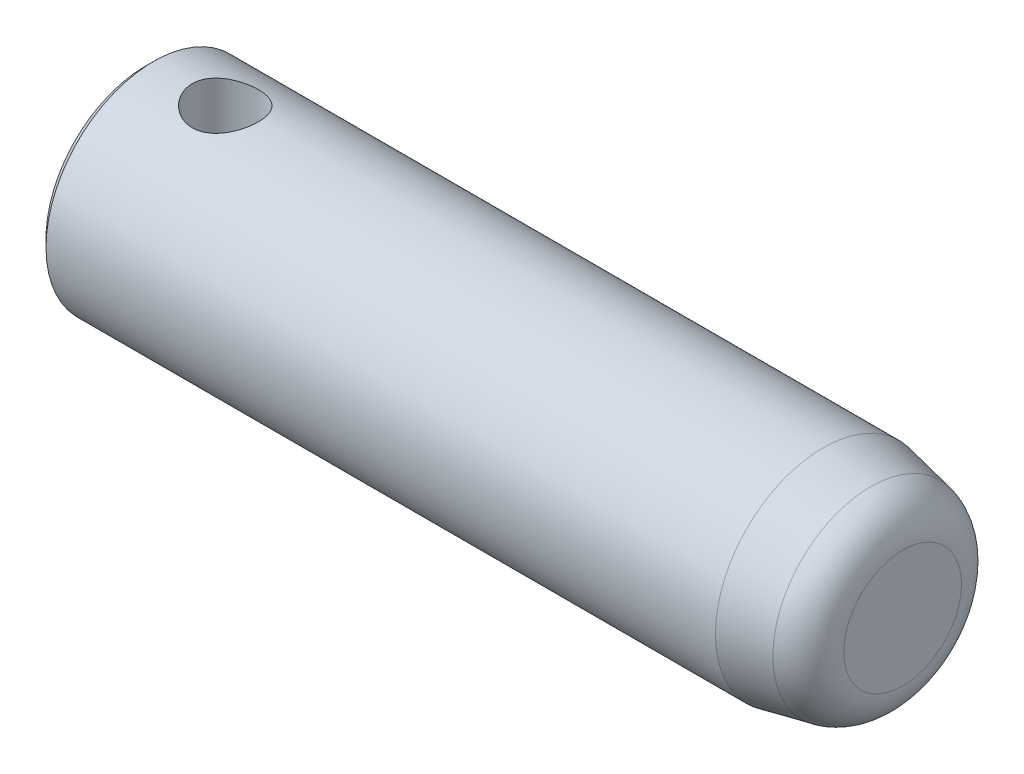
ISO-10303-21;
HEADER;
FILE_DESCRIPTION(('STEP AP214'),'2;1');
FILE_NAME('part.step','',(''),(''),'','','');
FILE_SCHEMA(('AUTOMOTIVE_DESIGN { 1 0 10303 214 1 1 1 1 }'));
ENDSEC;
DATA;
#1=APPLICATION_CONTEXT('core data for automotive mechanical design processes');
#2=APPLICATION_PROTOCOL_DEFINITION('international standard','automotive_design',2000,#1);
#3=PRODUCT_CONTEXT('',#1,'mechanical');
#4=PRODUCT('Part','Part','',(#3));
#5=PRODUCT_RELATED_PRODUCT_CATEGORY('part','',(#4));
#6=PRODUCT_DEFINITION_FORMATION('','',#4);
#7=PRODUCT_DEFINITION_CONTEXT('part definition',#1,'design');
#8=PRODUCT_DEFINITION('design','',#6,#7);
#9=PRODUCT_DEFINITION_SHAPE('','',#8);
#10=(LENGTH_UNIT() NAMED_UNIT(*) SI_UNIT(.MILLI.,.METRE.));
#11=(NAMED_UNIT(*) PLANE_ANGLE_UNIT() SI_UNIT($,.RADIAN.));
#12=(NAMED_UNIT(*) SI_UNIT($,.STERADIAN.) SOLID_ANGLE_UNIT());
#13=UNCERTAINTY_MEASURE_WITH_UNIT(LENGTH_MEASURE(1.E-05),#10,'distance_accuracy_value','');
#14=(GEOMETRIC_REPRESENTATION_CONTEXT(3) GLOBAL_UNCERTAINTY_ASSIGNED_CONTEXT((#13)) GLOBAL_UNIT_ASSIGNED_CONTEXT((#10,
#11,#12)) REPRESENTATION_CONTEXT('',''));
#15=CARTESIAN_POINT('',(0.,0.,0.));
#16=DIRECTION('',(0.,0.,1.));
#17=DIRECTION('',(1.,0.,0.));
#18=AXIS2_PLACEMENT_3D('',#15,#16,#17);
#19=CARTESIAN_POINT('',(95.,0.,0.));
#20=DIRECTION('',(-1.,0.,0.));
#21=DIRECTION('',(0.,0.,1.));
#22=AXIS2_PLACEMENT_3D('',#19,#20,#21);
#23=CYLINDRICAL_SURFACE('',#22,13.5);
#24=CARTESIAN_POINT('',(5.85,-13.5,0.));
#25=CARTESIAN_POINT('',(5.85000202340181,-13.4999985114752,0.227402156007268));
#26=CARTESIAN_POINT('',(5.86875273926511,-13.4941997302581,0.454824968339302));
#27=CARTESIAN_POINT('',(5.94307125364936,-13.4716346966968,0.903031316792986));
#28=CARTESIAN_POINT('',(5.99864847090315,-13.4548656386125,1.12381313931206));
#29=CARTESIAN_POINT('',(6.14457699874578,-13.4121942288627,1.55220891966356));
#30=CARTESIAN_POINT('',(6.23487551705309,-13.3863057478862,1.75984231361689));
#31=CARTESIAN_POINT('',(6.44746213115252,-13.3280758153734,2.1570209355603));
#32=CARTESIAN_POINT('',(6.56975494935885,-13.2957334113942,2.34656348766923));
#33=CARTESIAN_POINT('',(6.84672125546269,-13.2269507421959,2.70786538277092));
#34=CARTESIAN_POINT('',(7.00218042183089,-13.1904233620054,2.87900580260451));
#35=CARTESIAN_POINT('',(7.33939296074517,-13.1178983594875,3.19324322225718));
#36=CARTESIAN_POINT('',(7.52115102099837,-13.0819008328682,3.33633521178909));
#37=CARTESIAN_POINT('',(7.91111002046801,-13.0135819629174,3.59372900090108));
#38=CARTESIAN_POINT('',(8.11983715068285,-12.9813684442808,3.70726493005124));
#39=CARTESIAN_POINT('',(8.55457239406956,-12.9255717824294,3.89736840380634));
#40=CARTESIAN_POINT('',(8.78057610485526,-12.9019864494003,3.97394533010134));
#41=CARTESIAN_POINT('',(9.23647883648235,-12.867026401145,4.08570588385706));
#42=CARTESIAN_POINT('',(9.46607056790325,-12.8553147095788,4.12203473020294));
#43=CARTESIAN_POINT('',(9.92836599565647,-12.8444266713359,4.15584500674148));
#44=CARTESIAN_POINT('',(10.1610688799085,-12.8452471149403,4.15333638394895));
#45=CARTESIAN_POINT('',(10.6135742797313,-12.8590327013092,4.11044021260337));
#46=CARTESIAN_POINT('',(10.8335304736431,-12.8715338595716,4.07149974371518));
#47=CARTESIAN_POINT('',(11.263623003534,-12.9065198430853,3.95918810327311));
#48=CARTESIAN_POINT('',(11.4737583241693,-12.9290056981048,3.88581338030964));
#49=CARTESIAN_POINT('',(11.8817293241424,-12.9817891067039,3.70567612723075));
#50=CARTESIAN_POINT('',(12.0793472718526,-13.0121933290453,3.5984530779988));
#51=CARTESIAN_POINT('',(12.4542645180682,-13.0773378249785,3.35398276504338));
#52=CARTESIAN_POINT('',(12.6315586656091,-13.1120791931579,3.21672791543712));
#53=CARTESIAN_POINT('',(12.968987565674,-13.1838532734004,2.90895386576822));
#54=CARTESIAN_POINT('',(13.1280251328282,-13.2209195702755,2.73723745155003));
#55=CARTESIAN_POINT('',(13.4153084348377,-13.2918172589167,2.36911014946947));
#56=CARTESIAN_POINT('',(13.5435520334012,-13.3256484261519,2.17269754978058));
#57=CARTESIAN_POINT('',(13.7663184515394,-13.3865998005739,1.75868848152416));
#58=CARTESIAN_POINT('',(13.8605871185585,-13.4136689807238,1.54094724254517));
#59=CARTESIAN_POINT('',(14.0108363972219,-13.457678365562,1.09167347800342));
#60=CARTESIAN_POINT('',(14.066828243966,-13.4746215422742,0.860145021006421));
#61=CARTESIAN_POINT('',(14.1370829400978,-13.4959950029713,0.399188106412072));
#62=CARTESIAN_POINT('',(14.1528317975624,-13.5008706668949,0.170006448803975));
#63=CARTESIAN_POINT('',(14.1463330724631,-13.498872619694,-0.287745416691621));
#64=CARTESIAN_POINT('',(14.1240908422031,-13.4920005636251,-0.516315706166913));
#65=CARTESIAN_POINT('',(14.043437895994,-13.4675714515657,-0.960675494497211));
#66=CARTESIAN_POINT('',(13.9859048486332,-13.4502738512498,-1.17663991931202));
#67=CARTESIAN_POINT('',(13.8373681819906,-13.4070082324494,-1.59579566926548));
#68=CARTESIAN_POINT('',(13.7463604713559,-13.381039154152,-1.79898542949823));
#69=CARTESIAN_POINT('',(13.5310238449964,-13.3223373717104,-2.19221812267538));
#70=CARTESIAN_POINT('',(13.4059511280695,-13.2894579633788,-2.38183124869987));
#71=CARTESIAN_POINT('',(13.1269318949357,-13.220701610105,-2.73787962413219));
#72=CARTESIAN_POINT('',(12.9729777899448,-13.1848238787098,-2.90430876171323));
#73=CARTESIAN_POINT('',(12.6335792260664,-13.1123897918169,-3.21587033057997));
#74=CARTESIAN_POINT('',(12.4471553110202,-13.075859990711,-3.35994433065731));
#75=CARTESIAN_POINT('',(12.0519825161036,-13.0077026722783,-3.61485020488153));
#76=CARTESIAN_POINT('',(11.8432340927135,-12.9760750547466,-3.7256827585564));
#77=CARTESIAN_POINT('',(11.4098705696321,-12.9216601439022,-3.91023966396336));
#78=CARTESIAN_POINT('',(11.1853270931831,-12.8988356468056,-3.98412058305053));
#79=CARTESIAN_POINT('',(10.7261463855507,-12.8647768867868,-4.09277666601773));
#80=CARTESIAN_POINT('',(10.4915128685211,-12.853538396449,-4.12756609372601));
#81=CARTESIAN_POINT('',(10.0298484534816,-12.8443547896536,-4.15604952644762));
#82=CARTESIAN_POINT('',(9.80293419356281,-12.8458494569784,-4.15147530687562));
#83=CARTESIAN_POINT('',(9.35327329552538,-12.8606085993591,-4.10552258575548));
#84=CARTESIAN_POINT('',(9.13052647502666,-12.8738725581183,-4.06414569867098));
#85=CARTESIAN_POINT('',(8.69851045070577,-12.9102906828205,-3.94690468087593));
#86=CARTESIAN_POINT('',(8.48909840021822,-12.9333068485791,-3.87152084296221));
#87=CARTESIAN_POINT('',(8.08572717691659,-12.9866047993612,-3.6887820730902));
#88=CARTESIAN_POINT('',(7.89177108265201,-13.0168880270587,-3.58142079187376));
#89=CARTESIAN_POINT('',(7.51683686550757,-13.0827447309675,-3.33299815357153));
#90=CARTESIAN_POINT('',(7.33663257207719,-13.1184755716584,-3.19081067615643));
#91=CARTESIAN_POINT('',(7.00208083647706,-13.1904614239745,-2.87877202274273));
#92=CARTESIAN_POINT('',(6.84774024503557,-13.2267165717234,-2.7089135407234));
#93=CARTESIAN_POINT('',(6.56448108276189,-13.2970238815157,-2.3399697344458));
#94=CARTESIAN_POINT('',(6.43650688508655,-13.3309718952768,-2.14013736722608));
#95=CARTESIAN_POINT('',(6.21614372184271,-13.3915568619035,-1.72075073501905));
#96=CARTESIAN_POINT('',(6.1237396618073,-13.4181969145775,-1.50120488448952));
#97=CARTESIAN_POINT('',(5.9845018162803,-13.4591133603792,-1.0699118830548));
#98=CARTESIAN_POINT('',(5.93420534725839,-13.4743153877928,-0.859366298679375));
#99=CARTESIAN_POINT('',(5.86695659896587,-13.4947584828185,-0.432552652041231));
#100=CARTESIAN_POINT('',(5.84999807551158,-13.5000014157587,-0.216285669086049));
#101=CARTESIAN_POINT('',(5.85,-13.5,0.));
#102=B_SPLINE_CURVE_WITH_KNOTS('',3,(#24,#25,#26,#27,#28,#29,#30,#31,#32,#33,#34,#35,#36,#37,
#38,#39,#40,#41,#42,#43,#44,#45,#46,#47,#48,#49,#50,#51,#52,#53,#54,#55,#56,#57,#58,#59,#60,#61,
#62,#63,#64,#65,#66,#67,#68,#69,#70,#71,#72,#73,#74,#75,#76,#77,#78,#79,#80,#81,#82,#83,#84,#85,
#86,#87,#88,#89,#90,#91,#92,#93,#94,#95,#96,#97,#98,#99,#100,#101),.UNSPECIFIED.,.T.,.F.,(4,2,2,
2,2,2,2,2,2,2,2,2,2,2,2,2,2,2,2,2,2,2,2,2,2,2,2,2,2,2,2,2,2,2,2,2,2,2,4),(0.,0.681411690440881,
1.36299772579499,2.04355151003841,2.72420580193038,3.42325233322634,4.1224236215387,
4.83822754434267,5.55384967146527,6.24854021504379,6.94305283810007,7.61109995028716,
8.27921597729631,8.95684502644676,9.63464543931847,10.3422469398868,11.0498975152189,
11.7627369355173,12.4753670316182,13.1612752230664,13.8470867895824,14.5164975718987,
15.1859901983923,15.871470040127,16.5571302493392,17.2690237307241,17.9809026584545,
18.6897391832454,19.3983169814273,20.0758863108633,20.7534259180761,21.4216822525062,
22.0900713606422,22.7838735745449,23.4778592719708,24.1935164223663,24.9088695423617,
25.5570920478896,26.2051931300331),.UNSPECIFIED.);
#103=CARTESIAN_POINT('',(5.85,-13.5,0.));
#104=VERTEX_POINT('',#103);
#105=EDGE_CURVE('E10',#104,#104,#102,.T.);
#106=ORIENTED_EDGE('',*,*,#105,.T.);
#107=EDGE_LOOP('',(#106));
#108=FACE_BOUND('',#107,.T.);
#109=CARTESIAN_POINT('',(10.,12.8463029701156,4.15));
#110=CARTESIAN_POINT('',(9.77288449885896,12.8463047842096,4.14999791484521));
#111=CARTESIAN_POINT('',(9.54574827118026,12.8523917865702,4.13129275762828));
#112=CARTESIAN_POINT('',(9.09813541595152,12.8759787683418,4.05717160171071));
#113=CARTESIAN_POINT('',(8.87766078166853,12.8934821290287,4.0017447267632));
#114=CARTESIAN_POINT('',(8.4499179024404,12.9377361113224,3.856255299434));
#115=CARTESIAN_POINT('',(8.24262758492175,12.9644707685038,3.76625251191156));
#116=CARTESIAN_POINT('',(7.84603384222285,13.0241530776548,3.55436430480319));
#117=CARTESIAN_POINT('',(7.6567334047186,13.0571017589184,3.43247360199043));
#118=CARTESIAN_POINT('',(7.29520133405408,13.1267278392127,3.1559315543126));
#119=CARTESIAN_POINT('',(7.12365575147214,13.1634876680811,3.00040385949659));
#120=CARTESIAN_POINT('',(6.8086242097277,13.2358916135968,2.66287906943618));
#121=CARTESIAN_POINT('',(6.66514203826471,13.2715355790922,2.48087840692568));
#122=CARTESIAN_POINT('',(6.4073027797623,13.338631872184,2.09066440767528));
#123=CARTESIAN_POINT('',(6.29364932709461,13.3699757983396,1.8819658605435));
#124=CARTESIAN_POINT('',(6.10332112394402,13.4239798326833,1.44728956570271));
#125=CARTESIAN_POINT('',(6.02663797801328,13.446641912159,1.22131575448505));
#126=CARTESIAN_POINT('',(5.91470944339354,13.4801454834137,0.765684369091679));
#127=CARTESIAN_POINT('',(5.87829211538088,13.4913205782832,0.536339665430527));
#128=CARTESIAN_POINT('',(5.84421886853166,13.5017678782203,0.074541337623861));
#129=CARTESIAN_POINT('',(5.84655441473565,13.5010427042114,-0.157911590695686));
#130=CARTESIAN_POINT('',(5.88914320471778,13.4880049130053,-0.611090556462095));
#131=CARTESIAN_POINT('',(5.92812656210611,13.4760803789996,-0.831948873919814));
#132=CARTESIAN_POINT('',(6.04082455358163,13.4424587007822,-1.26382158570544));
#133=CARTESIAN_POINT('',(6.11454142714086,13.4207609264368,-1.47483534433303));
#134=CARTESIAN_POINT('',(6.29544783264006,13.3695033996681,-1.88399546018735));
#135=CARTESIAN_POINT('',(6.40302848427346,13.3398524133939,-2.08195698696888));
#136=CARTESIAN_POINT('',(6.64829668956187,13.2758211993198,-2.45741721809194));
#137=CARTESIAN_POINT('',(6.78599166582034,13.2414398063416,-2.63491086099056));
#138=CARTESIAN_POINT('',(7.09412704323475,13.1699765733594,-2.97197187035371));
#139=CARTESIAN_POINT('',(7.26566539710195,13.1328417504362,-3.13052564885637));
#140=CARTESIAN_POINT('',(7.6332499503723,13.0612618732235,-3.416911664224));
#141=CARTESIAN_POINT('',(7.8292988419596,13.0268171150811,-3.54474052181601));
#142=CARTESIAN_POINT('',(8.24312256386861,12.9642557899595,-3.76717659675817));
#143=CARTESIAN_POINT('',(8.46110408668669,12.9362095404299,-3.86142051742425));
#144=CARTESIAN_POINT('',(8.91091060566633,12.8904492968349,-4.01155180899296));
#145=CARTESIAN_POINT('',(9.14273078784329,12.8727317326059,-4.06745243463537));
#146=CARTESIAN_POINT('',(9.60394948408696,12.8504237182641,-4.13737998578399));
#147=CARTESIAN_POINT('',(9.83309009356361,12.8453484458011,-4.15295436448047));
#148=CARTESIAN_POINT('',(10.2907224776814,12.8475558187241,-4.14612211739931));
#149=CARTESIAN_POINT('',(10.5192143435984,12.8548366295615,-4.12372112995123));
#150=CARTESIAN_POINT('',(10.9624870510525,12.8804582994468,-4.04295502268181));
#151=CARTESIAN_POINT('',(11.1774723593521,12.898487307467,-3.98560297671617));
#152=CARTESIAN_POINT('',(11.5947485986119,12.9432465562406,-3.83774611218052));
#153=CARTESIAN_POINT('',(11.7970374978707,12.9699781853896,-3.74723600336243));
#154=CARTESIAN_POINT('',(12.1894292662159,13.0300580801291,-3.53274483261642));
#155=CARTESIAN_POINT('',(12.3790339859478,13.0635702934754,-3.40789954340683));
#156=CARTESIAN_POINT('',(12.735166708153,13.1330907287301,-3.1292979656566));
#157=CARTESIAN_POINT('',(12.9016888910507,13.1690995766703,-2.9755344091802));
#158=CARTESIAN_POINT('',(13.2137817941,13.2412950293509,-2.63615858155592));
#159=CARTESIAN_POINT('',(13.3582511477337,13.2774313766643,-2.44952016933533));
#160=CARTESIAN_POINT('',(13.6138564567792,13.344369547755,-2.0537803483545));
#161=CARTESIAN_POINT('',(13.7249939977936,13.3751716252554,-1.84468000875659));
#162=CARTESIAN_POINT('',(13.9097104889776,13.4277892680528,-1.41128233901749));
#163=CARTESIAN_POINT('',(13.9835655074833,13.4496706492953,-1.18711107028729));
#164=CARTESIAN_POINT('',(14.0922941645326,13.4822715286278,-0.728741372138431));
#165=CARTESIAN_POINT('',(14.127179568685,13.4929943956016,-0.494545991359257));
#166=CARTESIAN_POINT('',(14.1560479258765,13.5018542990328,-0.0329305123319394));
#167=CARTESIAN_POINT('',(14.1516243064606,13.500481657559,0.194381729843089));
#168=CARTESIAN_POINT('',(14.1058353402755,13.4864714831434,0.644879959588649));
#169=CARTESIAN_POINT('',(14.0644722707646,13.4738346446215,0.86806620065486));
#170=CARTESIAN_POINT('',(13.9469817509808,13.4388648547716,1.30140631905661));
#171=CARTESIAN_POINT('',(13.8712689797515,13.4166477135907,1.51168261907092));
#172=CARTESIAN_POINT('',(13.6876011949254,13.3648107667423,1.91665250020114));
#173=CARTESIAN_POINT('',(13.579640741196,13.335189712184,2.11134344506003));
#174=CARTESIAN_POINT('',(13.3303995360331,13.27042328993,2.48663408704732));
#175=CARTESIAN_POINT('',(13.18813302969,13.2351273660123,2.6665528873539));
#176=CARTESIAN_POINT('',(12.8760717238212,13.1634441732756,3.00049402614425));
#177=CARTESIAN_POINT('',(12.7062688156049,13.1270565855729,3.15450870930119));
#178=CARTESIAN_POINT('',(12.3374894263298,13.0559430285234,3.43719476764095));
#179=CARTESIAN_POINT('',(12.1377578603029,13.0213064956527,3.5649062440569));
#180=CARTESIAN_POINT('',(11.7186376074969,12.9591050848439,3.78480218816787));
#181=CARTESIAN_POINT('',(11.4992575478503,12.9315371236233,3.87700215468403));
#182=CARTESIAN_POINT('',(11.068426540922,12.8890467191889,4.01587437323286));
#183=CARTESIAN_POINT('',(10.8581877305809,12.8731749494369,4.06602756781778));
#184=CARTESIAN_POINT('',(10.4319713212141,12.8518033874259,4.13308760585193));
#185=CARTESIAN_POINT('',(10.2159950338688,12.8463012448467,4.15000198305742));
#186=CARTESIAN_POINT('',(10.,12.8463029701156,4.15));
#187=B_SPLINE_CURVE_WITH_KNOTS('',3,(#109,#110,#111,#112,#113,#114,#115,#116,#117,#118,#119,
#120,#121,#122,#123,#124,#125,#126,#127,#128,#129,#130,#131,#132,#133,#134,#135,#136,#137,#138,
#139,#140,#141,#142,#143,#144,#145,#146,#147,#148,#149,#150,#151,#152,#153,#154,#155,#156,#157,
#158,#159,#160,#161,#162,#163,#164,#165,#166,#167,#168,#169,#170,#171,#172,#173,#174,#175,#176,
#177,#178,#179,#180,#181,#182,#183,#184,#185,#186),.UNSPECIFIED.,.T.,.F.,(4,2,2,2,2,2,2,2,2,2,2,
2,2,2,2,2,2,2,2,2,2,2,2,2,2,2,2,2,2,2,2,2,2,2,2,2,2,2,4),(0.,0.680549084652289,1.36129982465343,
2.04087913546462,2.72057111115027,3.42074023366924,4.12100379242479,4.83654336953536,
5.55192038083112,6.24587838467192,6.93968355275745,7.61030050617571,8.28096070409195,
8.95967015758107,9.63854708884927,10.3448436706241,11.0512178987472,11.765016459472,
12.4785681455123,13.1643026571878,13.8499353644846,14.5165819551689,15.1833349532411,
15.8687101074997,16.5542577456563,17.2671647043234,17.9800377444493,18.6875517153368,
19.3948520175874,20.0736162558869,20.7523386523405,21.4230768137189,22.0939281915248,
22.7870138620613,23.480303998552,24.1956059451273,24.9105953470198,25.5579688222137,
26.2051955498051),.UNSPECIFIED.);
#188=CARTESIAN_POINT('',(10.,12.8463029701156,4.15));
#189=VERTEX_POINT('',#188);
#190=EDGE_CURVE('E52',#189,#189,#187,.T.);
#191=ORIENTED_EDGE('',*,*,#190,.T.);
#192=EDGE_LOOP('',(#191));
#193=FACE_BOUND('',#192,.T.);
#194=CARTESIAN_POINT('',(1.,0.,0.));
#195=DIRECTION('',(1.,0.,0.));
#196=DIRECTION('',(0.,0.,-1.));
#197=AXIS2_PLACEMENT_3D('',#194,#195,#196);
#198=CIRCLE('',#197,13.5);
#199=CARTESIAN_POINT('',(1.,0.,-13.5));
#200=VERTEX_POINT('',#199);
#201=EDGE_CURVE('E60',#200,#200,#198,.T.);
#202=ORIENTED_EDGE('',*,*,#201,.T.);
#203=EDGE_LOOP('',(#202));
#204=FACE_BOUND('',#203,.T.);
#205=CARTESIAN_POINT('',(85.,0.,0.));
#206=DIRECTION('',(1.,0.,0.));
#207=DIRECTION('',(0.,0.,-1.));
#208=AXIS2_PLACEMENT_3D('',#205,#206,#207);
#209=CIRCLE('',#208,13.5);
#210=CARTESIAN_POINT('',(85.,0.,-13.5));
#211=VERTEX_POINT('',#210);
#212=EDGE_CURVE('E98',#211,#211,#209,.F.);
#213=ORIENTED_EDGE('',*,*,#212,.T.);
#214=EDGE_LOOP('',(#213));
#215=FACE_BOUND('',#214,.T.);
#216=ADVANCED_FACE('F39',(#108,#193,#204,#215),#23,.T.);
#217=CARTESIAN_POINT('',(95.,0.,0.));
#218=DIRECTION('',(1.,0.,0.));
#219=DIRECTION('',(0.,0.,-1.));
#220=AXIS2_PLACEMENT_3D('',#217,#218,#219);
#221=PLANE('',#220);
#222=CARTESIAN_POINT('',(95.,0.,0.));
#223=DIRECTION('',(1.,0.,0.));
#224=DIRECTION('',(0.,0.,-1.));
#225=AXIS2_PLACEMENT_3D('',#222,#223,#224);
#226=CIRCLE('',#225,7.38030565633472);
#227=CARTESIAN_POINT('',(95.,0.,-7.38030565633472));
#228=VERTEX_POINT('',#227);
#229=EDGE_CURVE('E100',#228,#228,#226,.T.);
#230=ORIENTED_EDGE('',*,*,#229,.T.);
#231=EDGE_LOOP('',(#230));
#232=FACE_BOUND('',#231,.T.);
#233=ADVANCED_FACE('F74',(#232),#221,.T.);
#234=CARTESIAN_POINT('',(0.,0.,0.));
#235=DIRECTION('',(1.,0.,0.));
#236=DIRECTION('',(0.,0.,-1.));
#237=AXIS2_PLACEMENT_3D('',#234,#235,#236);
#238=PLANE('',#237);
#239=CARTESIAN_POINT('',(0.,0.,0.));
#240=DIRECTION('',(1.,0.,0.));
#241=DIRECTION('',(0.,0.,-1.));
#242=AXIS2_PLACEMENT_3D('',#239,#240,#241);
#243=CIRCLE('',#242,12.5);
#244=CARTESIAN_POINT('',(0.,0.,-12.5));
#245=VERTEX_POINT('',#244);
#246=EDGE_CURVE('E56',#245,#245,#243,.F.);
#247=ORIENTED_EDGE('',*,*,#246,.T.);
#248=EDGE_LOOP('',(#247));
#249=FACE_BOUND('',#248,.T.);
#250=ADVANCED_FACE('F77',(#249),#238,.F.);
#251=CARTESIAN_POINT('',(95.,0.,0.));
#252=DIRECTION('',(-1.,0.,0.));
#253=DIRECTION('',(0.,0.,1.));
#254=AXIS2_PLACEMENT_3D('',#251,#252,#253);
#255=CONICAL_SURFACE('',#254,11.465477005763,0.200712863979345);
#256=CARTESIAN_POINT('',(90.996839672086,0.,0.));
#257=DIRECTION('',(1.,0.,0.));
#258=DIRECTION('',(0.,0.,-1.));
#259=AXIS2_PLACEMENT_3D('',#256,#257,#258);
#260=CIRCLE('',#259,12.2799291794389);
#261=CARTESIAN_POINT('',(90.996839672086,0.,-12.2799291794389));
#262=VERTEX_POINT('',#261);
#263=EDGE_CURVE('E103',#262,#262,#260,.F.);
#264=ORIENTED_EDGE('',*,*,#263,.T.);
#265=EDGE_LOOP('',(#264));
#266=FACE_BOUND('',#265,.T.);
#267=ORIENTED_EDGE('',*,*,#212,.F.);
#268=EDGE_LOOP('',(#267));
#269=FACE_BOUND('',#268,.T.);
#270=ADVANCED_FACE('F80',(#266,#269),#255,.T.);
#271=CARTESIAN_POINT('',(90.,0.,0.));
#272=DIRECTION('',(1.,0.,0.));
#273=DIRECTION('',(0.,0.,-1.));
#274=AXIS2_PLACEMENT_3D('',#271,#272,#273);
#275=TOROIDAL_SURFACE('',#274,7.38030565633472,5.);
#276=ORIENTED_EDGE('',*,*,#263,.F.);
#277=EDGE_LOOP('',(#276));
#278=FACE_BOUND('',#277,.T.);
#279=ORIENTED_EDGE('',*,*,#229,.F.);
#280=EDGE_LOOP('',(#279));
#281=FACE_BOUND('',#280,.T.);
#282=ADVANCED_FACE('F87',(#278,#281),#275,.T.);
#283=CARTESIAN_POINT('',(1.,0.,0.));
#284=DIRECTION('',(1.,0.,0.));
#285=DIRECTION('',(0.,0.,-1.));
#286=AXIS2_PLACEMENT_3D('',#283,#284,#285);
#287=CONICAL_SURFACE('',#286,13.5,0.785398163397449);
#288=ORIENTED_EDGE('',*,*,#246,.F.);
#289=EDGE_LOOP('',(#288));
#290=FACE_BOUND('',#289,.T.);
#291=ORIENTED_EDGE('',*,*,#201,.F.);
#292=EDGE_LOOP('',(#291));
#293=FACE_BOUND('',#292,.T.);
#294=ADVANCED_FACE('F42',(#290,#293),#287,.T.);
#295=CARTESIAN_POINT('',(10.,-13.5,0.));
#296=DIRECTION('',(0.,1.,0.));
#297=DIRECTION('',(0.,0.,1.));
#298=AXIS2_PLACEMENT_3D('',#295,#296,#297);
#299=CYLINDRICAL_SURFACE('',#298,4.15);
#300=ORIENTED_EDGE('',*,*,#190,.F.);
#301=EDGE_LOOP('',(#300));
#302=FACE_BOUND('',#301,.T.);
#303=ORIENTED_EDGE('',*,*,#105,.F.);
#304=EDGE_LOOP('',(#303));
#305=FACE_BOUND('',#304,.T.);
#306=ADVANCED_FACE('F69',(#302,#305),#299,.F.);
#307=CLOSED_SHELL('',(#216,#233,#250,#270,#282,#294,#306));
#308=MANIFOLD_SOLID_BREP('B2',#307);
#309=ADVANCED_BREP_SHAPE_REPRESENTATION('',(#18,#308),#14);
#310=SHAPE_DEFINITION_REPRESENTATION(#9,#309);
ENDSEC;
END-ISO-10303-21;
